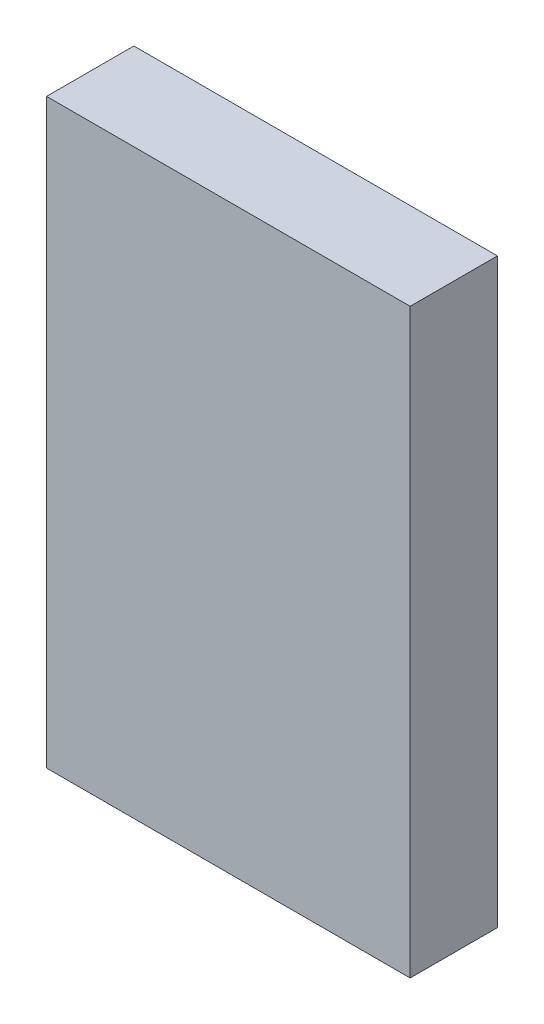
ISO-10303-21;
HEADER;
FILE_DESCRIPTION(('STEP AP214'),'2;1');
FILE_NAME('part.step','',(''),(''),'','','');
FILE_SCHEMA(('AUTOMOTIVE_DESIGN { 1 0 10303 214 1 1 1 1 }'));
ENDSEC;
DATA;
#1=APPLICATION_CONTEXT('core data for automotive mechanical design processes');
#2=APPLICATION_PROTOCOL_DEFINITION('international standard','automotive_design',2000,#1);
#3=PRODUCT_CONTEXT('',#1,'mechanical');
#4=PRODUCT('Part','Part','',(#3));
#5=PRODUCT_RELATED_PRODUCT_CATEGORY('part','',(#4));
#6=PRODUCT_DEFINITION_FORMATION('','',#4);
#7=PRODUCT_DEFINITION_CONTEXT('part definition',#1,'design');
#8=PRODUCT_DEFINITION('design','',#6,#7);
#9=PRODUCT_DEFINITION_SHAPE('','',#8);
#10=(LENGTH_UNIT() NAMED_UNIT(*) SI_UNIT(.MILLI.,.METRE.));
#11=(NAMED_UNIT(*) PLANE_ANGLE_UNIT() SI_UNIT($,.RADIAN.));
#12=(NAMED_UNIT(*) SI_UNIT($,.STERADIAN.) SOLID_ANGLE_UNIT());
#13=UNCERTAINTY_MEASURE_WITH_UNIT(LENGTH_MEASURE(1.E-05),#10,'distance_accuracy_value','');
#14=(GEOMETRIC_REPRESENTATION_CONTEXT(3) GLOBAL_UNCERTAINTY_ASSIGNED_CONTEXT((#13)) GLOBAL_UNIT_ASSIGNED_CONTEXT((#10,
#11,#12)) REPRESENTATION_CONTEXT('',''));
#15=CARTESIAN_POINT('',(0.,0.,0.));
#16=DIRECTION('',(0.,0.,1.));
#17=DIRECTION('',(1.,0.,0.));
#18=AXIS2_PLACEMENT_3D('',#15,#16,#17);
#19=CARTESIAN_POINT('',(0.62500002,-1.00000054,0.2999994));
#20=DIRECTION('',(0.,0.,1.));
#21=DIRECTION('',(1.,0.,0.));
#22=AXIS2_PLACEMENT_3D('',#19,#20,#21);
#23=PLANE('',#22);
#24=DIRECTION('',(0.,1.,0.));
#25=VECTOR('',#24,1.);
#26=CARTESIAN_POINT('',(-0.62499748,-1.00000054,0.2999994));
#27=LINE('',#26,#25);
#28=CARTESIAN_POINT('',(-0.62499748,-1.00000054,0.2999994));
#29=VERTEX_POINT('',#28);
#30=CARTESIAN_POINT('',(-0.62499748,1.00000054,0.2999994));
#31=VERTEX_POINT('',#30);
#32=EDGE_CURVE('E53',#29,#31,#27,.T.);
#33=ORIENTED_EDGE('',*,*,#32,.F.);
#34=DIRECTION('',(1.,0.,0.));
#35=VECTOR('',#34,1.);
#36=CARTESIAN_POINT('',(0.62500002,-1.00000054,0.2999994));
#37=LINE('',#36,#35);
#38=CARTESIAN_POINT('',(0.62500002,-1.00000054,0.2999994));
#39=VERTEX_POINT('',#38);
#40=EDGE_CURVE('E20',#29,#39,#37,.T.);
#41=ORIENTED_EDGE('',*,*,#40,.T.);
#42=DIRECTION('',(0.,1.,0.));
#43=VECTOR('',#42,1.);
#44=CARTESIAN_POINT('',(0.62500002,1.00000054,0.2999994));
#45=LINE('',#44,#43);
#46=CARTESIAN_POINT('',(0.62500002,1.00000054,0.2999994));
#47=VERTEX_POINT('',#46);
#48=EDGE_CURVE('E67',#47,#39,#45,.F.);
#49=ORIENTED_EDGE('',*,*,#48,.F.);
#50=DIRECTION('',(1.,0.,0.));
#51=VECTOR('',#50,1.);
#52=CARTESIAN_POINT('',(-0.62499748,1.00000054,0.2999994));
#53=LINE('',#52,#51);
#54=EDGE_CURVE('E58',#31,#47,#53,.T.);
#55=ORIENTED_EDGE('',*,*,#54,.F.);
#56=EDGE_LOOP('',(#33,#41,#49,#55));
#57=FACE_BOUND('',#56,.T.);
#58=ADVANCED_FACE('F17',(#57),#23,.T.);
#59=CARTESIAN_POINT('',(0.62500002,1.00000054,0.));
#60=DIRECTION('',(1.,0.,0.));
#61=DIRECTION('',(0.,0.,-1.));
#62=AXIS2_PLACEMENT_3D('',#59,#60,#61);
#63=PLANE('',#62);
#64=DIRECTION('',(0.,0.,-1.));
#65=VECTOR('',#64,1.);
#66=CARTESIAN_POINT('',(0.62500002,-1.00000054,0.));
#67=LINE('',#66,#65);
#68=CARTESIAN_POINT('',(0.62500002,-1.00000054,0.));
#69=VERTEX_POINT('',#68);
#70=EDGE_CURVE('E80',#69,#39,#67,.F.);
#71=ORIENTED_EDGE('',*,*,#70,.F.);
#72=DIRECTION('',(0.,1.,0.));
#73=VECTOR('',#72,1.);
#74=CARTESIAN_POINT('',(0.62500002,-1.00000054,0.));
#75=LINE('',#74,#73);
#76=CARTESIAN_POINT('',(0.62500002,1.00000054,0.));
#77=VERTEX_POINT('',#76);
#78=EDGE_CURVE('E75',#69,#77,#75,.T.);
#79=ORIENTED_EDGE('',*,*,#78,.T.);
#80=DIRECTION('',(0.,0.,1.));
#81=VECTOR('',#80,1.);
#82=CARTESIAN_POINT('',(0.62500002,1.00000054,0.));
#83=LINE('',#82,#81);
#84=EDGE_CURVE('E63',#47,#77,#83,.F.);
#85=ORIENTED_EDGE('',*,*,#84,.F.);
#86=ORIENTED_EDGE('',*,*,#48,.T.);
#87=EDGE_LOOP('',(#71,#79,#85,#86));
#88=FACE_BOUND('',#87,.T.);
#89=ADVANCED_FACE('F74',(#88),#63,.T.);
#90=CARTESIAN_POINT('',(-0.62499748,1.00000054,0.));
#91=DIRECTION('',(0.,1.,0.));
#92=DIRECTION('',(0.,0.,1.));
#93=AXIS2_PLACEMENT_3D('',#90,#91,#92);
#94=PLANE('',#93);
#95=ORIENTED_EDGE('',*,*,#84,.T.);
#96=DIRECTION('',(1.,0.,0.));
#97=VECTOR('',#96,1.);
#98=CARTESIAN_POINT('',(0.62500002,1.00000054,0.));
#99=LINE('',#98,#97);
#100=CARTESIAN_POINT('',(-0.62499748,1.00000054,0.));
#101=VERTEX_POINT('',#100);
#102=EDGE_CURVE('E84',#77,#101,#99,.F.);
#103=ORIENTED_EDGE('',*,*,#102,.T.);
#104=DIRECTION('',(0.,0.,1.));
#105=VECTOR('',#104,1.);
#106=CARTESIAN_POINT('',(-0.62499748,1.00000054,0.));
#107=LINE('',#106,#105);
#108=EDGE_CURVE('E65',#31,#101,#107,.F.);
#109=ORIENTED_EDGE('',*,*,#108,.F.);
#110=ORIENTED_EDGE('',*,*,#54,.T.);
#111=EDGE_LOOP('',(#95,#103,#109,#110));
#112=FACE_BOUND('',#111,.T.);
#113=ADVANCED_FACE('F60',(#112),#94,.T.);
#114=CARTESIAN_POINT('',(-0.62499748,-1.00000054,0.));
#115=DIRECTION('',(-1.,0.,0.));
#116=DIRECTION('',(0.,0.,1.));
#117=AXIS2_PLACEMENT_3D('',#114,#115,#116);
#118=PLANE('',#117);
#119=ORIENTED_EDGE('',*,*,#108,.T.);
#120=DIRECTION('',(0.,1.,0.));
#121=VECTOR('',#120,1.);
#122=CARTESIAN_POINT('',(-0.62499748,-1.00000054,0.));
#123=LINE('',#122,#121);
#124=CARTESIAN_POINT('',(-0.62499748,-1.00000054,0.));
#125=VERTEX_POINT('',#124);
#126=EDGE_CURVE('E26',#101,#125,#123,.F.);
#127=ORIENTED_EDGE('',*,*,#126,.T.);
#128=DIRECTION('',(0.,0.,-1.));
#129=VECTOR('',#128,1.);
#130=CARTESIAN_POINT('',(-0.62499748,-1.00000054,0.));
#131=LINE('',#130,#129);
#132=EDGE_CURVE('E34',#29,#125,#131,.T.);
#133=ORIENTED_EDGE('',*,*,#132,.F.);
#134=ORIENTED_EDGE('',*,*,#32,.T.);
#135=EDGE_LOOP('',(#119,#127,#133,#134));
#136=FACE_BOUND('',#135,.T.);
#137=ADVANCED_FACE('F88',(#136),#118,.T.);
#138=CARTESIAN_POINT('',(0.62500002,-1.00000054,0.));
#139=DIRECTION('',(0.,-1.,0.));
#140=DIRECTION('',(0.,0.,-1.));
#141=AXIS2_PLACEMENT_3D('',#138,#139,#140);
#142=PLANE('',#141);
#143=ORIENTED_EDGE('',*,*,#132,.T.);
#144=DIRECTION('',(1.,0.,0.));
#145=VECTOR('',#144,1.);
#146=CARTESIAN_POINT('',(0.62500002,-1.00000054,0.));
#147=LINE('',#146,#145);
#148=EDGE_CURVE('E11',#125,#69,#147,.T.);
#149=ORIENTED_EDGE('',*,*,#148,.T.);
#150=ORIENTED_EDGE('',*,*,#70,.T.);
#151=ORIENTED_EDGE('',*,*,#40,.F.);
#152=EDGE_LOOP('',(#143,#149,#150,#151));
#153=FACE_BOUND('',#152,.T.);
#154=ADVANCED_FACE('F91',(#153),#142,.T.);
#155=CARTESIAN_POINT('',(0.62500002,-1.00000054,0.));
#156=DIRECTION('',(0.,0.,1.));
#157=DIRECTION('',(1.,0.,0.));
#158=AXIS2_PLACEMENT_3D('',#155,#156,#157);
#159=PLANE('',#158);
#160=ORIENTED_EDGE('',*,*,#126,.F.);
#161=ORIENTED_EDGE('',*,*,#102,.F.);
#162=ORIENTED_EDGE('',*,*,#78,.F.);
#163=ORIENTED_EDGE('',*,*,#148,.F.);
#164=EDGE_LOOP('',(#160,#161,#162,#163));
#165=FACE_BOUND('',#164,.T.);
#166=ADVANCED_FACE('F90',(#165),#159,.F.);
#167=CLOSED_SHELL('',(#58,#89,#113,#137,#154,#166));
#168=MANIFOLD_SOLID_BREP('B1',#167);
#169=ADVANCED_BREP_SHAPE_REPRESENTATION('',(#18,#168),#14);
#170=SHAPE_DEFINITION_REPRESENTATION(#9,#169);
ENDSEC;
END-ISO-10303-21;
